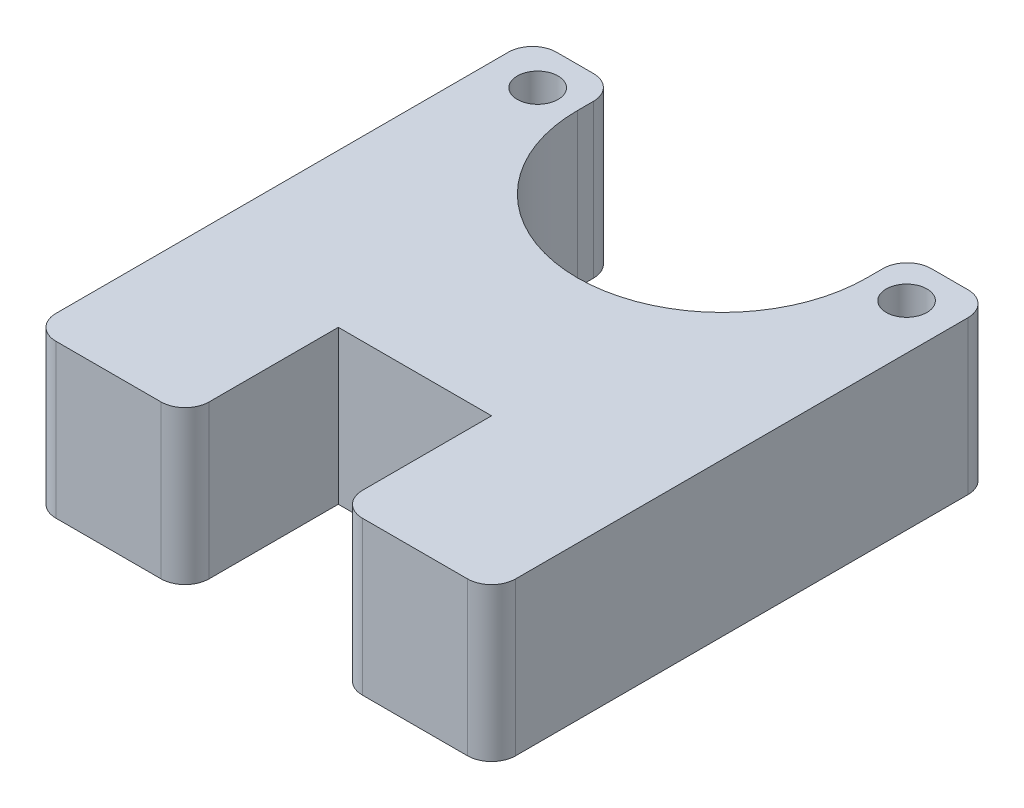
ISO-10303-21;
HEADER;
FILE_DESCRIPTION(('STEP AP214'),'2;1');
FILE_NAME('part.step','',(''),(''),'','','');
FILE_SCHEMA(('AUTOMOTIVE_DESIGN { 1 0 10303 214 1 1 1 1 }'));
ENDSEC;
DATA;
#1=APPLICATION_CONTEXT('core data for automotive mechanical design processes');
#2=APPLICATION_PROTOCOL_DEFINITION('international standard','automotive_design',2000,#1);
#3=PRODUCT_CONTEXT('',#1,'mechanical');
#4=PRODUCT('Part','Part','',(#3));
#5=PRODUCT_RELATED_PRODUCT_CATEGORY('part','',(#4));
#6=PRODUCT_DEFINITION_FORMATION('','',#4);
#7=PRODUCT_DEFINITION_CONTEXT('part definition',#1,'design');
#8=PRODUCT_DEFINITION('design','',#6,#7);
#9=PRODUCT_DEFINITION_SHAPE('','',#8);
#10=(LENGTH_UNIT() NAMED_UNIT(*) SI_UNIT(.MILLI.,.METRE.));
#11=(NAMED_UNIT(*) PLANE_ANGLE_UNIT() SI_UNIT($,.RADIAN.));
#12=(NAMED_UNIT(*) SI_UNIT($,.STERADIAN.) SOLID_ANGLE_UNIT());
#13=UNCERTAINTY_MEASURE_WITH_UNIT(LENGTH_MEASURE(1.E-05),#10,'distance_accuracy_value','');
#14=(GEOMETRIC_REPRESENTATION_CONTEXT(3) GLOBAL_UNCERTAINTY_ASSIGNED_CONTEXT((#13)) GLOBAL_UNIT_ASSIGNED_CONTEXT((#10,
#11,#12)) REPRESENTATION_CONTEXT('',''));
#15=CARTESIAN_POINT('',(0.,0.,0.));
#16=DIRECTION('',(0.,0.,1.));
#17=DIRECTION('',(1.,0.,0.));
#18=AXIS2_PLACEMENT_3D('',#15,#16,#17);
#19=CARTESIAN_POINT('',(19.05,6.35,0.));
#20=DIRECTION('',(-1.,0.,0.));
#21=DIRECTION('',(0.,0.,1.));
#22=AXIS2_PLACEMENT_3D('',#19,#20,#21);
#23=PLANE('',#22);
#24=DIRECTION('',(0.,0.,-1.));
#25=VECTOR('',#24,1.);
#26=CARTESIAN_POINT('',(19.05,6.35,0.));
#27=LINE('',#26,#25);
#28=CARTESIAN_POINT('',(19.05,6.35,5.35));
#29=VERTEX_POINT('',#28);
#30=CARTESIAN_POINT('',(19.05,6.35,-13.393729658));
#31=VERTEX_POINT('',#30);
#32=EDGE_CURVE('E269',#29,#31,#27,.T.);
#33=ORIENTED_EDGE('',*,*,#32,.F.);
#34=DIRECTION('',(0.,-1.,0.));
#35=VECTOR('',#34,1.);
#36=CARTESIAN_POINT('',(19.05,0.,5.35));
#37=LINE('',#36,#35);
#38=CARTESIAN_POINT('',(19.05,0.,5.35));
#39=VERTEX_POINT('',#38);
#40=EDGE_CURVE('E276',#29,#39,#37,.T.);
#41=ORIENTED_EDGE('',*,*,#40,.T.);
#42=DIRECTION('',(0.,0.,-1.));
#43=VECTOR('',#42,1.);
#44=CARTESIAN_POINT('',(19.05,0.,0.));
#45=LINE('',#44,#43);
#46=CARTESIAN_POINT('',(19.05,0.,-13.393729658));
#47=VERTEX_POINT('',#46);
#48=EDGE_CURVE('E232',#39,#47,#45,.T.);
#49=ORIENTED_EDGE('',*,*,#48,.T.);
#50=DIRECTION('',(0.,-1.,0.));
#51=VECTOR('',#50,1.);
#52=CARTESIAN_POINT('',(19.05,6.35,-13.393729658));
#53=LINE('',#52,#51);
#54=EDGE_CURVE('E187',#47,#31,#53,.F.);
#55=ORIENTED_EDGE('',*,*,#54,.T.);
#56=EDGE_LOOP('',(#33,#41,#49,#55));
#57=FACE_BOUND('',#56,.T.);
#58=ADVANCED_FACE('F35',(#57),#23,.F.);
#59=CARTESIAN_POINT('',(0.,6.35,-14.393729658));
#60=DIRECTION('',(0.,0.,1.));
#61=DIRECTION('',(1.,0.,0.));
#62=AXIS2_PLACEMENT_3D('',#59,#60,#61);
#63=PLANE('',#62);
#64=DIRECTION('',(-1.,0.,0.));
#65=VECTOR('',#64,1.);
#66=CARTESIAN_POINT('',(0.,6.35,-14.393729658));
#67=LINE('',#66,#65);
#68=CARTESIAN_POINT('',(18.05,6.35,-14.393729658));
#69=VERTEX_POINT('',#68);
#70=CARTESIAN_POINT('',(16.5250007,6.35,-14.393729658));
#71=VERTEX_POINT('',#70);
#72=EDGE_CURVE('E199',#69,#71,#67,.T.);
#73=ORIENTED_EDGE('',*,*,#72,.F.);
#74=DIRECTION('',(0.,-1.,0.));
#75=VECTOR('',#74,1.);
#76=CARTESIAN_POINT('',(18.05,6.35,-14.393729658));
#77=LINE('',#76,#75);
#78=CARTESIAN_POINT('',(18.05,0.,-14.393729658));
#79=VERTEX_POINT('',#78);
#80=EDGE_CURVE('E330',#69,#79,#77,.T.);
#81=ORIENTED_EDGE('',*,*,#80,.T.);
#82=DIRECTION('',(-1.,0.,0.));
#83=VECTOR('',#82,1.);
#84=CARTESIAN_POINT('',(0.,0.,-14.393729658));
#85=LINE('',#84,#83);
#86=CARTESIAN_POINT('',(16.5250007,0.,-14.393729658));
#87=VERTEX_POINT('',#86);
#88=EDGE_CURVE('E235',#79,#87,#85,.T.);
#89=ORIENTED_EDGE('',*,*,#88,.T.);
#90=DIRECTION('',(0.,-1.,0.));
#91=VECTOR('',#90,1.);
#92=CARTESIAN_POINT('',(16.5250007,6.35,-14.393729658));
#93=LINE('',#92,#91);
#94=EDGE_CURVE('E328',#87,#71,#93,.F.);
#95=ORIENTED_EDGE('',*,*,#94,.T.);
#96=EDGE_LOOP('',(#73,#81,#89,#95));
#97=FACE_BOUND('',#96,.T.);
#98=ADVANCED_FACE('F394',(#97),#63,.F.);
#99=CARTESIAN_POINT('',(15.5250007,6.35,0.));
#100=DIRECTION('',(-1.,0.,0.));
#101=DIRECTION('',(0.,0.,1.));
#102=AXIS2_PLACEMENT_3D('',#99,#100,#101);
#103=PLANE('',#102);
#104=DIRECTION('',(0.,0.,-1.));
#105=VECTOR('',#104,1.);
#106=CARTESIAN_POINT('',(15.5250007,6.35,0.));
#107=LINE('',#106,#105);
#108=CARTESIAN_POINT('',(15.5250007,6.35,-12.7287274));
#109=VERTEX_POINT('',#108);
#110=CARTESIAN_POINT('',(15.5250007,6.35,-13.393729658));
#111=VERTEX_POINT('',#110);
#112=EDGE_CURVE('E179',#109,#111,#107,.T.);
#113=ORIENTED_EDGE('',*,*,#112,.T.);
#114=DIRECTION('',(0.,-1.,0.));
#115=VECTOR('',#114,1.);
#116=CARTESIAN_POINT('',(15.5250007,0.,-13.393729658));
#117=LINE('',#116,#115);
#118=CARTESIAN_POINT('',(15.5250007,0.,-13.393729658));
#119=VERTEX_POINT('',#118);
#120=EDGE_CURVE('E333',#111,#119,#117,.T.);
#121=ORIENTED_EDGE('',*,*,#120,.T.);
#122=DIRECTION('',(0.,0.,-1.));
#123=VECTOR('',#122,1.);
#124=CARTESIAN_POINT('',(15.5250007,0.,0.));
#125=LINE('',#124,#123);
#126=CARTESIAN_POINT('',(15.5250007,0.,-12.7287274));
#127=VERTEX_POINT('',#126);
#128=EDGE_CURVE('E182',#127,#119,#125,.T.);
#129=ORIENTED_EDGE('',*,*,#128,.F.);
#130=DIRECTION('',(0.,-1.,0.));
#131=VECTOR('',#130,1.);
#132=CARTESIAN_POINT('',(15.5250007,6.35,-12.7287274));
#133=LINE('',#132,#131);
#134=EDGE_CURVE('E175',#109,#127,#133,.T.);
#135=ORIENTED_EDGE('',*,*,#134,.F.);
#136=EDGE_LOOP('',(#113,#121,#129,#135));
#137=FACE_BOUND('',#136,.T.);
#138=ADVANCED_FACE('F177',(#137),#103,.T.);
#139=CARTESIAN_POINT('',(9.525,6.35,-12.7287274));
#140=DIRECTION('',(0.,-1.,0.));
#141=DIRECTION('',(0.,0.,-1.));
#142=AXIS2_PLACEMENT_3D('',#139,#140,#141);
#143=CYLINDRICAL_SURFACE('',#142,6.0000007);
#144=CARTESIAN_POINT('',(9.525,0.,-12.7287274));
#145=DIRECTION('',(0.,1.,0.));
#146=DIRECTION('',(0.,0.,1.));
#147=AXIS2_PLACEMENT_3D('',#144,#145,#146);
#148=CIRCLE('',#147,6.0000007);
#149=CARTESIAN_POINT('',(3.52499930000392,0.,-12.7287274));
#150=VERTEX_POINT('',#149);
#151=EDGE_CURVE('E239',#150,#127,#148,.T.);
#152=ORIENTED_EDGE('',*,*,#151,.F.);
#153=DIRECTION('',(0.,-1.,0.));
#154=VECTOR('',#153,1.);
#155=CARTESIAN_POINT('',(3.52499930000392,6.35,-12.7287274));
#156=LINE('',#155,#154);
#157=CARTESIAN_POINT('',(3.52499930000392,6.35,-12.7287274));
#158=VERTEX_POINT('',#157);
#159=EDGE_CURVE('E188',#158,#150,#156,.T.);
#160=ORIENTED_EDGE('',*,*,#159,.F.);
#161=CARTESIAN_POINT('',(9.525,6.35,-12.7287274));
#162=DIRECTION('',(0.,1.,0.));
#163=DIRECTION('',(0.,0.,1.));
#164=AXIS2_PLACEMENT_3D('',#161,#162,#163);
#165=CIRCLE('',#164,6.0000007);
#166=EDGE_CURVE('E195',#158,#109,#165,.T.);
#167=ORIENTED_EDGE('',*,*,#166,.T.);
#168=ORIENTED_EDGE('',*,*,#134,.T.);
#169=EDGE_LOOP('',(#152,#160,#167,#168));
#170=FACE_BOUND('',#169,.T.);
#171=ADVANCED_FACE('F201',(#170),#143,.F.);
#172=CARTESIAN_POINT('',(3.52499930000392,6.35,0.));
#173=DIRECTION('',(-1.,0.,0.));
#174=DIRECTION('',(0.,0.,1.));
#175=AXIS2_PLACEMENT_3D('',#172,#173,#174);
#176=PLANE('',#175);
#177=DIRECTION('',(0.,0.,-1.));
#178=VECTOR('',#177,1.);
#179=CARTESIAN_POINT('',(3.52499930000392,0.,0.));
#180=LINE('',#179,#178);
#181=CARTESIAN_POINT('',(3.52499930000392,0.,-13.393729658));
#182=VERTEX_POINT('',#181);
#183=EDGE_CURVE('E241',#150,#182,#180,.T.);
#184=ORIENTED_EDGE('',*,*,#183,.T.);
#185=DIRECTION('',(0.,-1.,0.));
#186=VECTOR('',#185,1.);
#187=CARTESIAN_POINT('',(3.52499930000392,6.35,-13.393729658));
#188=LINE('',#187,#186);
#189=CARTESIAN_POINT('',(3.52499930000392,6.35,-13.393729658));
#190=VERTEX_POINT('',#189);
#191=EDGE_CURVE('E11',#182,#190,#188,.F.);
#192=ORIENTED_EDGE('',*,*,#191,.T.);
#193=DIRECTION('',(0.,0.,-1.));
#194=VECTOR('',#193,1.);
#195=CARTESIAN_POINT('',(3.52499930000392,6.35,0.));
#196=LINE('',#195,#194);
#197=EDGE_CURVE('E203',#158,#190,#196,.T.);
#198=ORIENTED_EDGE('',*,*,#197,.F.);
#199=ORIENTED_EDGE('',*,*,#159,.T.);
#200=EDGE_LOOP('',(#184,#192,#198,#199));
#201=FACE_BOUND('',#200,.T.);
#202=ADVANCED_FACE('F431',(#201),#176,.F.);
#203=CARTESIAN_POINT('',(0.,6.35,-14.393729658));
#204=DIRECTION('',(0.,0.,-1.));
#205=DIRECTION('',(-1.,0.,0.));
#206=AXIS2_PLACEMENT_3D('',#203,#204,#205);
#207=PLANE('',#206);
#208=DIRECTION('',(1.,0.,0.));
#209=VECTOR('',#208,1.);
#210=CARTESIAN_POINT('',(0.,6.35,-14.393729658));
#211=LINE('',#210,#209);
#212=CARTESIAN_POINT('',(1.,6.35,-14.393729658));
#213=VERTEX_POINT('',#212);
#214=CARTESIAN_POINT('',(2.52499930000392,6.35,-14.393729658));
#215=VERTEX_POINT('',#214);
#216=EDGE_CURVE('E205',#213,#215,#211,.T.);
#217=ORIENTED_EDGE('',*,*,#216,.T.);
#218=DIRECTION('',(0.,-1.,0.));
#219=VECTOR('',#218,1.);
#220=CARTESIAN_POINT('',(2.52499930000392,0.,-14.393729658));
#221=LINE('',#220,#219);
#222=CARTESIAN_POINT('',(2.52499930000392,0.,-14.393729658));
#223=VERTEX_POINT('',#222);
#224=EDGE_CURVE('E43',#215,#223,#221,.T.);
#225=ORIENTED_EDGE('',*,*,#224,.T.);
#226=DIRECTION('',(1.,0.,0.));
#227=VECTOR('',#226,1.);
#228=CARTESIAN_POINT('',(0.,0.,-14.393729658));
#229=LINE('',#228,#227);
#230=CARTESIAN_POINT('',(1.,0.,-14.393729658));
#231=VERTEX_POINT('',#230);
#232=EDGE_CURVE('E244',#231,#223,#229,.T.);
#233=ORIENTED_EDGE('',*,*,#232,.F.);
#234=DIRECTION('',(0.,-1.,0.));
#235=VECTOR('',#234,1.);
#236=CARTESIAN_POINT('',(1.,6.35,-14.393729658));
#237=LINE('',#236,#235);
#238=EDGE_CURVE('E335',#231,#213,#237,.F.);
#239=ORIENTED_EDGE('',*,*,#238,.T.);
#240=EDGE_LOOP('',(#217,#225,#233,#239));
#241=FACE_BOUND('',#240,.T.);
#242=ADVANCED_FACE('F340',(#241),#207,.T.);
#243=CARTESIAN_POINT('',(0.,6.35,0.));
#244=DIRECTION('',(-1.,0.,0.));
#245=DIRECTION('',(0.,0.,1.));
#246=AXIS2_PLACEMENT_3D('',#243,#244,#245);
#247=PLANE('',#246);
#248=DIRECTION('',(0.,0.,-1.));
#249=VECTOR('',#248,1.);
#250=CARTESIAN_POINT('',(0.,0.,0.));
#251=LINE('',#250,#249);
#252=CARTESIAN_POINT('',(0.,0.,5.35));
#253=VERTEX_POINT('',#252);
#254=CARTESIAN_POINT('',(0.,0.,-13.393729658));
#255=VERTEX_POINT('',#254);
#256=EDGE_CURVE('E247',#253,#255,#251,.T.);
#257=ORIENTED_EDGE('',*,*,#256,.F.);
#258=DIRECTION('',(0.,-1.,0.));
#259=VECTOR('',#258,1.);
#260=CARTESIAN_POINT('',(0.,6.35,5.35));
#261=LINE('',#260,#259);
#262=CARTESIAN_POINT('',(0.,6.35,5.35));
#263=VERTEX_POINT('',#262);
#264=EDGE_CURVE('E326',#253,#263,#261,.F.);
#265=ORIENTED_EDGE('',*,*,#264,.T.);
#266=DIRECTION('',(0.,0.,-1.));
#267=VECTOR('',#266,1.);
#268=CARTESIAN_POINT('',(0.,6.35,0.));
#269=LINE('',#268,#267);
#270=CARTESIAN_POINT('',(0.,6.35,-13.393729658));
#271=VERTEX_POINT('',#270);
#272=EDGE_CURVE('E211',#263,#271,#269,.T.);
#273=ORIENTED_EDGE('',*,*,#272,.T.);
#274=DIRECTION('',(0.,-1.,0.));
#275=VECTOR('',#274,1.);
#276=CARTESIAN_POINT('',(0.,6.35,-13.393729658));
#277=LINE('',#276,#275);
#278=EDGE_CURVE('E323',#271,#255,#277,.T.);
#279=ORIENTED_EDGE('',*,*,#278,.T.);
#280=EDGE_LOOP('',(#257,#265,#273,#279));
#281=FACE_BOUND('',#280,.T.);
#282=ADVANCED_FACE('F355',(#281),#247,.T.);
#283=CARTESIAN_POINT('',(0.,6.35,6.35));
#284=DIRECTION('',(0.,0.,-1.));
#285=DIRECTION('',(-1.,0.,0.));
#286=AXIS2_PLACEMENT_3D('',#283,#284,#285);
#287=PLANE('',#286);
#288=DIRECTION('',(1.,0.,0.));
#289=VECTOR('',#288,1.);
#290=CARTESIAN_POINT('',(0.,0.,6.35));
#291=LINE('',#290,#289);
#292=CARTESIAN_POINT('',(0.999999999999992,0.,6.35));
#293=VERTEX_POINT('',#292);
#294=CARTESIAN_POINT('',(5.35,0.,6.35));
#295=VERTEX_POINT('',#294);
#296=EDGE_CURVE('E250',#293,#295,#291,.T.);
#297=ORIENTED_EDGE('',*,*,#296,.T.);
#298=DIRECTION('',(0.,-1.,0.));
#299=VECTOR('',#298,1.);
#300=CARTESIAN_POINT('',(5.35,6.35,6.35));
#301=LINE('',#300,#299);
#302=CARTESIAN_POINT('',(5.35,6.35,6.35));
#303=VERTEX_POINT('',#302);
#304=EDGE_CURVE('E321',#295,#303,#301,.F.);
#305=ORIENTED_EDGE('',*,*,#304,.T.);
#306=DIRECTION('',(1.,0.,0.));
#307=VECTOR('',#306,1.);
#308=CARTESIAN_POINT('',(0.,6.35,6.35));
#309=LINE('',#308,#307);
#310=CARTESIAN_POINT('',(0.999999999999992,6.35,6.35));
#311=VERTEX_POINT('',#310);
#312=EDGE_CURVE('E214',#311,#303,#309,.T.);
#313=ORIENTED_EDGE('',*,*,#312,.F.);
#314=DIRECTION('',(0.,-1.,0.));
#315=VECTOR('',#314,1.);
#316=CARTESIAN_POINT('',(0.999999999999992,0.,6.35));
#317=LINE('',#316,#315);
#318=EDGE_CURVE('E318',#311,#293,#317,.T.);
#319=ORIENTED_EDGE('',*,*,#318,.T.);
#320=EDGE_LOOP('',(#297,#305,#313,#319));
#321=FACE_BOUND('',#320,.T.);
#322=ADVANCED_FACE('F365',(#321),#287,.F.);
#323=CARTESIAN_POINT('',(6.35,6.35,0.));
#324=DIRECTION('',(1.,0.,0.));
#325=DIRECTION('',(0.,0.,-1.));
#326=AXIS2_PLACEMENT_3D('',#323,#324,#325);
#327=PLANE('',#326);
#328=DIRECTION('',(0.,0.,1.));
#329=VECTOR('',#328,1.);
#330=CARTESIAN_POINT('',(6.35,6.35,0.));
#331=LINE('',#330,#329);
#332=CARTESIAN_POINT('',(6.35,6.35,0.));
#333=VERTEX_POINT('',#332);
#334=CARTESIAN_POINT('',(6.35,6.35,5.35));
#335=VERTEX_POINT('',#334);
#336=EDGE_CURVE('E216',#333,#335,#331,.T.);
#337=ORIENTED_EDGE('',*,*,#336,.T.);
#338=DIRECTION('',(0.,-1.,0.));
#339=VECTOR('',#338,1.);
#340=CARTESIAN_POINT('',(6.35,0.,5.35));
#341=LINE('',#340,#339);
#342=CARTESIAN_POINT('',(6.35,0.,5.35));
#343=VERTEX_POINT('',#342);
#344=EDGE_CURVE('E315',#335,#343,#341,.T.);
#345=ORIENTED_EDGE('',*,*,#344,.T.);
#346=DIRECTION('',(0.,0.,1.));
#347=VECTOR('',#346,1.);
#348=CARTESIAN_POINT('',(6.35,0.,0.));
#349=LINE('',#348,#347);
#350=CARTESIAN_POINT('',(6.35,0.,0.));
#351=VERTEX_POINT('',#350);
#352=EDGE_CURVE('E253',#351,#343,#349,.T.);
#353=ORIENTED_EDGE('',*,*,#352,.F.);
#354=DIRECTION('',(0.,-1.,0.));
#355=VECTOR('',#354,1.);
#356=CARTESIAN_POINT('',(6.35,6.35,0.));
#357=LINE('',#356,#355);
#358=EDGE_CURVE('E272',#333,#351,#357,.T.);
#359=ORIENTED_EDGE('',*,*,#358,.F.);
#360=EDGE_LOOP('',(#337,#345,#353,#359));
#361=FACE_BOUND('',#360,.T.);
#362=ADVANCED_FACE('F373',(#361),#327,.T.);
#363=CARTESIAN_POINT('',(0.,6.35,0.));
#364=DIRECTION('',(0.,0.,-1.));
#365=DIRECTION('',(-1.,0.,0.));
#366=AXIS2_PLACEMENT_3D('',#363,#364,#365);
#367=PLANE('',#366);
#368=DIRECTION('',(1.,0.,0.));
#369=VECTOR('',#368,1.);
#370=CARTESIAN_POINT('',(0.,0.,0.));
#371=LINE('',#370,#369);
#372=CARTESIAN_POINT('',(12.7,0.,0.));
#373=VERTEX_POINT('',#372);
#374=EDGE_CURVE('E256',#351,#373,#371,.T.);
#375=ORIENTED_EDGE('',*,*,#374,.T.);
#376=DIRECTION('',(0.,-1.,0.));
#377=VECTOR('',#376,1.);
#378=CARTESIAN_POINT('',(12.7,6.35,0.));
#379=LINE('',#378,#377);
#380=CARTESIAN_POINT('',(12.7,6.35,0.));
#381=VERTEX_POINT('',#380);
#382=EDGE_CURVE('E231',#381,#373,#379,.T.);
#383=ORIENTED_EDGE('',*,*,#382,.F.);
#384=DIRECTION('',(1.,0.,0.));
#385=VECTOR('',#384,1.);
#386=CARTESIAN_POINT('',(0.,6.35,0.));
#387=LINE('',#386,#385);
#388=EDGE_CURVE('E218',#333,#381,#387,.T.);
#389=ORIENTED_EDGE('',*,*,#388,.F.);
#390=ORIENTED_EDGE('',*,*,#358,.T.);
#391=EDGE_LOOP('',(#375,#383,#389,#390));
#392=FACE_BOUND('',#391,.T.);
#393=ADVANCED_FACE('F378',(#392),#367,.F.);
#394=CARTESIAN_POINT('',(12.7,6.35,0.));
#395=DIRECTION('',(1.,0.,0.));
#396=DIRECTION('',(0.,0.,-1.));
#397=AXIS2_PLACEMENT_3D('',#394,#395,#396);
#398=PLANE('',#397);
#399=DIRECTION('',(0.,0.,1.));
#400=VECTOR('',#399,1.);
#401=CARTESIAN_POINT('',(12.7,0.,0.));
#402=LINE('',#401,#400);
#403=CARTESIAN_POINT('',(12.7,0.,5.35));
#404=VERTEX_POINT('',#403);
#405=EDGE_CURVE('E258',#373,#404,#402,.T.);
#406=ORIENTED_EDGE('',*,*,#405,.T.);
#407=DIRECTION('',(0.,-1.,0.));
#408=VECTOR('',#407,1.);
#409=CARTESIAN_POINT('',(12.7,6.35,5.35));
#410=LINE('',#409,#408);
#411=CARTESIAN_POINT('',(12.7,6.35,5.35));
#412=VERTEX_POINT('',#411);
#413=EDGE_CURVE('E50',#404,#412,#410,.F.);
#414=ORIENTED_EDGE('',*,*,#413,.T.);
#415=DIRECTION('',(0.,0.,1.));
#416=VECTOR('',#415,1.);
#417=CARTESIAN_POINT('',(12.7,6.35,0.));
#418=LINE('',#417,#416);
#419=EDGE_CURVE('E220',#381,#412,#418,.T.);
#420=ORIENTED_EDGE('',*,*,#419,.F.);
#421=ORIENTED_EDGE('',*,*,#382,.T.);
#422=EDGE_LOOP('',(#406,#414,#420,#421));
#423=FACE_BOUND('',#422,.T.);
#424=ADVANCED_FACE('F380',(#423),#398,.F.);
#425=CARTESIAN_POINT('',(1.88250068000392,6.35,-12.728734258));
#426=DIRECTION('',(0.,-1.,0.));
#427=DIRECTION('',(0.,0.,-1.));
#428=AXIS2_PLACEMENT_3D('',#425,#426,#427);
#429=CYLINDRICAL_SURFACE('',#428,0.8449945);
#430=CARTESIAN_POINT('',(1.88250068000392,6.35,-12.728734258));
#431=DIRECTION('',(0.,1.,0.));
#432=DIRECTION('',(0.,0.,1.));
#433=AXIS2_PLACEMENT_3D('',#430,#431,#432);
#434=CIRCLE('',#433,0.8449945);
#435=CARTESIAN_POINT('',(1.88250068000392,6.35,-11.883739758));
#436=VERTEX_POINT('',#435);
#437=EDGE_CURVE('E225',#436,#436,#434,.T.);
#438=ORIENTED_EDGE('',*,*,#437,.T.);
#439=EDGE_LOOP('',(#438));
#440=FACE_BOUND('',#439,.T.);
#441=CARTESIAN_POINT('',(1.88250068000392,0.,-12.728734258));
#442=DIRECTION('',(0.,1.,0.));
#443=DIRECTION('',(0.,0.,1.));
#444=AXIS2_PLACEMENT_3D('',#441,#442,#443);
#445=CIRCLE('',#444,0.8449945);
#446=CARTESIAN_POINT('',(1.88250068000392,0.,-11.883739758));
#447=VERTEX_POINT('',#446);
#448=EDGE_CURVE('E263',#447,#447,#445,.T.);
#449=ORIENTED_EDGE('',*,*,#448,.F.);
#450=EDGE_LOOP('',(#449));
#451=FACE_BOUND('',#450,.T.);
#452=ADVANCED_FACE('F382',(#440,#451),#429,.F.);
#453=CARTESIAN_POINT('',(0.,6.35,6.35));
#454=DIRECTION('',(0.,0.,1.));
#455=DIRECTION('',(1.,0.,0.));
#456=AXIS2_PLACEMENT_3D('',#453,#454,#455);
#457=PLANE('',#456);
#458=DIRECTION('',(-1.,0.,0.));
#459=VECTOR('',#458,1.);
#460=CARTESIAN_POINT('',(0.,0.,6.35));
#461=LINE('',#460,#459);
#462=CARTESIAN_POINT('',(18.05,0.,6.35));
#463=VERTEX_POINT('',#462);
#464=CARTESIAN_POINT('',(13.7,0.,6.35));
#465=VERTEX_POINT('',#464);
#466=EDGE_CURVE('E260',#463,#465,#461,.T.);
#467=ORIENTED_EDGE('',*,*,#466,.F.);
#468=DIRECTION('',(0.,-1.,0.));
#469=VECTOR('',#468,1.);
#470=CARTESIAN_POINT('',(18.05,6.35,6.35));
#471=LINE('',#470,#469);
#472=CARTESIAN_POINT('',(18.05,6.35,6.35));
#473=VERTEX_POINT('',#472);
#474=EDGE_CURVE('E298',#463,#473,#471,.F.);
#475=ORIENTED_EDGE('',*,*,#474,.T.);
#476=DIRECTION('',(-1.,0.,0.));
#477=VECTOR('',#476,1.);
#478=CARTESIAN_POINT('',(0.,6.35,6.35));
#479=LINE('',#478,#477);
#480=CARTESIAN_POINT('',(13.7,6.35,6.35));
#481=VERTEX_POINT('',#480);
#482=EDGE_CURVE('E222',#473,#481,#479,.T.);
#483=ORIENTED_EDGE('',*,*,#482,.T.);
#484=DIRECTION('',(0.,-1.,0.));
#485=VECTOR('',#484,1.);
#486=CARTESIAN_POINT('',(13.7,0.,6.35));
#487=LINE('',#486,#485);
#488=EDGE_CURVE('E295',#481,#465,#487,.T.);
#489=ORIENTED_EDGE('',*,*,#488,.T.);
#490=EDGE_LOOP('',(#467,#475,#483,#489));
#491=FACE_BOUND('',#490,.T.);
#492=ADVANCED_FACE('F388',(#491),#457,.T.);
#493=CARTESIAN_POINT('',(17.16749932,6.35,-12.7287274));
#494=DIRECTION('',(0.,-1.,0.));
#495=DIRECTION('',(0.,0.,-1.));
#496=AXIS2_PLACEMENT_3D('',#493,#494,#495);
#497=CYLINDRICAL_SURFACE('',#496,0.844994500000003);
#498=CARTESIAN_POINT('',(17.16749932,6.35,-12.7287274));
#499=DIRECTION('',(0.,1.,0.));
#500=DIRECTION('',(0.,0.,1.));
#501=AXIS2_PLACEMENT_3D('',#498,#499,#500);
#502=CIRCLE('',#501,0.844994500000003);
#503=CARTESIAN_POINT('',(17.16749932,6.35,-11.8837329));
#504=VERTEX_POINT('',#503);
#505=EDGE_CURVE('E228',#504,#504,#502,.T.);
#506=ORIENTED_EDGE('',*,*,#505,.T.);
#507=EDGE_LOOP('',(#506));
#508=FACE_BOUND('',#507,.T.);
#509=CARTESIAN_POINT('',(17.16749932,0.,-12.7287274));
#510=DIRECTION('',(0.,1.,0.));
#511=DIRECTION('',(0.,0.,1.));
#512=AXIS2_PLACEMENT_3D('',#509,#510,#511);
#513=CIRCLE('',#512,0.844994500000003);
#514=CARTESIAN_POINT('',(17.16749932,0.,-11.8837329));
#515=VERTEX_POINT('',#514);
#516=EDGE_CURVE('E266',#515,#515,#513,.T.);
#517=ORIENTED_EDGE('',*,*,#516,.F.);
#518=EDGE_LOOP('',(#517));
#519=FACE_BOUND('',#518,.T.);
#520=ADVANCED_FACE('F447',(#508,#519),#497,.F.);
#521=CARTESIAN_POINT('',(0.,6.35,0.));
#522=DIRECTION('',(0.,1.,0.));
#523=DIRECTION('',(0.,0.,1.));
#524=AXIS2_PLACEMENT_3D('',#521,#522,#523);
#525=PLANE('',#524);
#526=ORIENTED_EDGE('',*,*,#482,.F.);
#527=CARTESIAN_POINT('',(18.05,6.35,5.35));
#528=DIRECTION('',(0.,1.,0.));
#529=DIRECTION('',(0.,0.,1.));
#530=AXIS2_PLACEMENT_3D('',#527,#528,#529);
#531=CIRCLE('',#530,1.);
#532=EDGE_CURVE('E312',#473,#29,#531,.T.);
#533=ORIENTED_EDGE('',*,*,#532,.T.);
#534=ORIENTED_EDGE('',*,*,#32,.T.);
#535=CARTESIAN_POINT('',(18.05,6.35,-13.393729658));
#536=DIRECTION('',(0.,1.,0.));
#537=DIRECTION('',(0.,0.,1.));
#538=AXIS2_PLACEMENT_3D('',#535,#536,#537);
#539=CIRCLE('',#538,1.);
#540=EDGE_CURVE('E305',#31,#69,#539,.T.);
#541=ORIENTED_EDGE('',*,*,#540,.T.);
#542=ORIENTED_EDGE('',*,*,#72,.T.);
#543=CARTESIAN_POINT('',(16.5250007,6.35,-13.393729658));
#544=DIRECTION('',(0.,1.,0.));
#545=DIRECTION('',(0.,0.,1.));
#546=AXIS2_PLACEMENT_3D('',#543,#544,#545);
#547=CIRCLE('',#546,1.);
#548=EDGE_CURVE('E198',#71,#111,#547,.T.);
#549=ORIENTED_EDGE('',*,*,#548,.T.);
#550=ORIENTED_EDGE('',*,*,#112,.F.);
#551=ORIENTED_EDGE('',*,*,#166,.F.);
#552=ORIENTED_EDGE('',*,*,#197,.T.);
#553=CARTESIAN_POINT('',(2.52499930000392,6.35,-13.393729658));
#554=DIRECTION('',(0.,1.,0.));
#555=DIRECTION('',(0.,0.,1.));
#556=AXIS2_PLACEMENT_3D('',#553,#554,#555);
#557=CIRCLE('',#556,1.);
#558=EDGE_CURVE('E302',#190,#215,#557,.T.);
#559=ORIENTED_EDGE('',*,*,#558,.T.);
#560=ORIENTED_EDGE('',*,*,#216,.F.);
#561=CARTESIAN_POINT('',(1.,6.35,-13.393729658));
#562=DIRECTION('',(0.,1.,0.));
#563=DIRECTION('',(0.,0.,1.));
#564=AXIS2_PLACEMENT_3D('',#561,#562,#563);
#565=CIRCLE('',#564,1.);
#566=EDGE_CURVE('E300',#213,#271,#565,.T.);
#567=ORIENTED_EDGE('',*,*,#566,.T.);
#568=ORIENTED_EDGE('',*,*,#272,.F.);
#569=CARTESIAN_POINT('',(0.999999999999992,6.35,5.35));
#570=DIRECTION('',(0.,1.,0.));
#571=DIRECTION('',(0.,0.,1.));
#572=AXIS2_PLACEMENT_3D('',#569,#570,#571);
#573=CIRCLE('',#572,1.);
#574=EDGE_CURVE('E307',#263,#311,#573,.T.);
#575=ORIENTED_EDGE('',*,*,#574,.T.);
#576=ORIENTED_EDGE('',*,*,#312,.T.);
#577=CARTESIAN_POINT('',(5.35,6.35,5.35));
#578=DIRECTION('',(0.,1.,0.));
#579=DIRECTION('',(0.,0.,1.));
#580=AXIS2_PLACEMENT_3D('',#577,#578,#579);
#581=CIRCLE('',#580,1.);
#582=EDGE_CURVE('E58',#303,#335,#581,.T.);
#583=ORIENTED_EDGE('',*,*,#582,.T.);
#584=ORIENTED_EDGE('',*,*,#336,.F.);
#585=ORIENTED_EDGE('',*,*,#388,.T.);
#586=ORIENTED_EDGE('',*,*,#419,.T.);
#587=CARTESIAN_POINT('',(13.7,6.35,5.35));
#588=DIRECTION('',(0.,1.,0.));
#589=DIRECTION('',(0.,0.,1.));
#590=AXIS2_PLACEMENT_3D('',#587,#588,#589);
#591=CIRCLE('',#590,1.);
#592=EDGE_CURVE('E310',#412,#481,#591,.T.);
#593=ORIENTED_EDGE('',*,*,#592,.T.);
#594=EDGE_LOOP('',(#526,#533,#534,#541,#542,#549,#550,#551,#552,#559,#560,#567,#568,#575,#576,
#583,#584,#585,#586,#593));
#595=FACE_BOUND('',#594,.T.);
#596=ORIENTED_EDGE('',*,*,#437,.F.);
#597=EDGE_LOOP('',(#596));
#598=FACE_BOUND('',#597,.T.);
#599=ORIENTED_EDGE('',*,*,#505,.F.);
#600=EDGE_LOOP('',(#599));
#601=FACE_BOUND('',#600,.T.);
#602=ADVANCED_FACE('F192',(#595,#598,#601),#525,.T.);
#603=CARTESIAN_POINT('',(0.,0.,0.));
#604=DIRECTION('',(0.,1.,0.));
#605=DIRECTION('',(0.,0.,1.));
#606=AXIS2_PLACEMENT_3D('',#603,#604,#605);
#607=PLANE('',#606);
#608=ORIENTED_EDGE('',*,*,#48,.F.);
#609=CARTESIAN_POINT('',(18.05,0.,5.35));
#610=DIRECTION('',(0.,1.,0.));
#611=DIRECTION('',(0.,0.,1.));
#612=AXIS2_PLACEMENT_3D('',#609,#610,#611);
#613=CIRCLE('',#612,1.);
#614=EDGE_CURVE('E293',#39,#463,#613,.F.);
#615=ORIENTED_EDGE('',*,*,#614,.T.);
#616=ORIENTED_EDGE('',*,*,#466,.T.);
#617=CARTESIAN_POINT('',(13.7,0.,5.35));
#618=DIRECTION('',(0.,1.,0.));
#619=DIRECTION('',(0.,0.,1.));
#620=AXIS2_PLACEMENT_3D('',#617,#618,#619);
#621=CIRCLE('',#620,1.);
#622=EDGE_CURVE('E291',#465,#404,#621,.F.);
#623=ORIENTED_EDGE('',*,*,#622,.T.);
#624=ORIENTED_EDGE('',*,*,#405,.F.);
#625=ORIENTED_EDGE('',*,*,#374,.F.);
#626=ORIENTED_EDGE('',*,*,#352,.T.);
#627=CARTESIAN_POINT('',(5.35,0.,5.35));
#628=DIRECTION('',(0.,1.,0.));
#629=DIRECTION('',(0.,0.,1.));
#630=AXIS2_PLACEMENT_3D('',#627,#628,#629);
#631=CIRCLE('',#630,1.);
#632=EDGE_CURVE('E289',#343,#295,#631,.F.);
#633=ORIENTED_EDGE('',*,*,#632,.T.);
#634=ORIENTED_EDGE('',*,*,#296,.F.);
#635=CARTESIAN_POINT('',(0.999999999999992,0.,5.35));
#636=DIRECTION('',(0.,1.,0.));
#637=DIRECTION('',(0.,0.,1.));
#638=AXIS2_PLACEMENT_3D('',#635,#636,#637);
#639=CIRCLE('',#638,1.);
#640=EDGE_CURVE('E287',#293,#253,#639,.F.);
#641=ORIENTED_EDGE('',*,*,#640,.T.);
#642=ORIENTED_EDGE('',*,*,#256,.T.);
#643=CARTESIAN_POINT('',(1.,0.,-13.393729658));
#644=DIRECTION('',(0.,1.,0.));
#645=DIRECTION('',(0.,0.,1.));
#646=AXIS2_PLACEMENT_3D('',#643,#644,#645);
#647=CIRCLE('',#646,1.);
#648=EDGE_CURVE('E279',#255,#231,#647,.F.);
#649=ORIENTED_EDGE('',*,*,#648,.T.);
#650=ORIENTED_EDGE('',*,*,#232,.T.);
#651=CARTESIAN_POINT('',(2.52499930000392,0.,-13.393729658));
#652=DIRECTION('',(0.,1.,0.));
#653=DIRECTION('',(0.,0.,1.));
#654=AXIS2_PLACEMENT_3D('',#651,#652,#653);
#655=CIRCLE('',#654,1.);
#656=EDGE_CURVE('E281',#223,#182,#655,.F.);
#657=ORIENTED_EDGE('',*,*,#656,.T.);
#658=ORIENTED_EDGE('',*,*,#183,.F.);
#659=ORIENTED_EDGE('',*,*,#151,.T.);
#660=ORIENTED_EDGE('',*,*,#128,.T.);
#661=CARTESIAN_POINT('',(16.5250007,0.,-13.393729658));
#662=DIRECTION('',(0.,1.,0.));
#663=DIRECTION('',(0.,0.,1.));
#664=AXIS2_PLACEMENT_3D('',#661,#662,#663);
#665=CIRCLE('',#664,1.);
#666=EDGE_CURVE('E283',#119,#87,#665,.F.);
#667=ORIENTED_EDGE('',*,*,#666,.T.);
#668=ORIENTED_EDGE('',*,*,#88,.F.);
#669=CARTESIAN_POINT('',(18.05,0.,-13.393729658));
#670=DIRECTION('',(0.,1.,0.));
#671=DIRECTION('',(0.,0.,1.));
#672=AXIS2_PLACEMENT_3D('',#669,#670,#671);
#673=CIRCLE('',#672,1.);
#674=EDGE_CURVE('E285',#79,#47,#673,.F.);
#675=ORIENTED_EDGE('',*,*,#674,.T.);
#676=EDGE_LOOP('',(#608,#615,#616,#623,#624,#625,#626,#633,#634,#641,#642,#649,#650,#657,#658,
#659,#660,#667,#668,#675));
#677=FACE_BOUND('',#676,.T.);
#678=ORIENTED_EDGE('',*,*,#448,.T.);
#679=EDGE_LOOP('',(#678));
#680=FACE_BOUND('',#679,.T.);
#681=ORIENTED_EDGE('',*,*,#516,.T.);
#682=EDGE_LOOP('',(#681));
#683=FACE_BOUND('',#682,.T.);
#684=ADVANCED_FACE('F347',(#677,#680,#683),#607,.F.);
#685=CARTESIAN_POINT('',(18.05,6.35,5.35));
#686=DIRECTION('',(0.,1.,0.));
#687=DIRECTION('',(0.,0.,1.));
#688=AXIS2_PLACEMENT_3D('',#685,#686,#687);
#689=CYLINDRICAL_SURFACE('',#688,1.);
#690=ORIENTED_EDGE('',*,*,#532,.F.);
#691=ORIENTED_EDGE('',*,*,#474,.F.);
#692=ORIENTED_EDGE('',*,*,#614,.F.);
#693=ORIENTED_EDGE('',*,*,#40,.F.);
#694=EDGE_LOOP('',(#690,#691,#692,#693));
#695=FACE_BOUND('',#694,.T.);
#696=ADVANCED_FACE('F405',(#695),#689,.T.);
#697=CARTESIAN_POINT('',(13.7,6.35,5.35));
#698=DIRECTION('',(0.,1.,0.));
#699=DIRECTION('',(0.,0.,1.));
#700=AXIS2_PLACEMENT_3D('',#697,#698,#699);
#701=CYLINDRICAL_SURFACE('',#700,1.);
#702=ORIENTED_EDGE('',*,*,#592,.F.);
#703=ORIENTED_EDGE('',*,*,#413,.F.);
#704=ORIENTED_EDGE('',*,*,#622,.F.);
#705=ORIENTED_EDGE('',*,*,#488,.F.);
#706=EDGE_LOOP('',(#702,#703,#704,#705));
#707=FACE_BOUND('',#706,.T.);
#708=ADVANCED_FACE('F408',(#707),#701,.T.);
#709=CARTESIAN_POINT('',(5.35,6.35,5.35));
#710=DIRECTION('',(0.,1.,0.));
#711=DIRECTION('',(0.,0.,1.));
#712=AXIS2_PLACEMENT_3D('',#709,#710,#711);
#713=CYLINDRICAL_SURFACE('',#712,1.);
#714=ORIENTED_EDGE('',*,*,#582,.F.);
#715=ORIENTED_EDGE('',*,*,#304,.F.);
#716=ORIENTED_EDGE('',*,*,#632,.F.);
#717=ORIENTED_EDGE('',*,*,#344,.F.);
#718=EDGE_LOOP('',(#714,#715,#716,#717));
#719=FACE_BOUND('',#718,.T.);
#720=ADVANCED_FACE('F371',(#719),#713,.T.);
#721=CARTESIAN_POINT('',(0.999999999999992,6.35,5.35));
#722=DIRECTION('',(0.,1.,0.));
#723=DIRECTION('',(0.,0.,1.));
#724=AXIS2_PLACEMENT_3D('',#721,#722,#723);
#725=CYLINDRICAL_SURFACE('',#724,1.);
#726=ORIENTED_EDGE('',*,*,#574,.F.);
#727=ORIENTED_EDGE('',*,*,#264,.F.);
#728=ORIENTED_EDGE('',*,*,#640,.F.);
#729=ORIENTED_EDGE('',*,*,#318,.F.);
#730=EDGE_LOOP('',(#726,#727,#728,#729));
#731=FACE_BOUND('',#730,.T.);
#732=ADVANCED_FACE('F362',(#731),#725,.T.);
#733=CARTESIAN_POINT('',(18.05,6.35,-13.393729658));
#734=DIRECTION('',(0.,-1.,0.));
#735=DIRECTION('',(0.,0.,-1.));
#736=AXIS2_PLACEMENT_3D('',#733,#734,#735);
#737=CYLINDRICAL_SURFACE('',#736,1.);
#738=ORIENTED_EDGE('',*,*,#540,.F.);
#739=ORIENTED_EDGE('',*,*,#54,.F.);
#740=ORIENTED_EDGE('',*,*,#674,.F.);
#741=ORIENTED_EDGE('',*,*,#80,.F.);
#742=EDGE_LOOP('',(#738,#739,#740,#741));
#743=FACE_BOUND('',#742,.T.);
#744=ADVANCED_FACE('F417',(#743),#737,.T.);
#745=CARTESIAN_POINT('',(16.5250007,6.35,-13.393729658));
#746=DIRECTION('',(0.,1.,0.));
#747=DIRECTION('',(0.,0.,1.));
#748=AXIS2_PLACEMENT_3D('',#745,#746,#747);
#749=CYLINDRICAL_SURFACE('',#748,1.);
#750=ORIENTED_EDGE('',*,*,#548,.F.);
#751=ORIENTED_EDGE('',*,*,#94,.F.);
#752=ORIENTED_EDGE('',*,*,#666,.F.);
#753=ORIENTED_EDGE('',*,*,#120,.F.);
#754=EDGE_LOOP('',(#750,#751,#752,#753));
#755=FACE_BOUND('',#754,.T.);
#756=ADVANCED_FACE('F420',(#755),#749,.T.);
#757=CARTESIAN_POINT('',(2.52499930000392,6.35,-13.393729658));
#758=DIRECTION('',(0.,1.,0.));
#759=DIRECTION('',(0.,0.,1.));
#760=AXIS2_PLACEMENT_3D('',#757,#758,#759);
#761=CYLINDRICAL_SURFACE('',#760,1.);
#762=ORIENTED_EDGE('',*,*,#558,.F.);
#763=ORIENTED_EDGE('',*,*,#191,.F.);
#764=ORIENTED_EDGE('',*,*,#656,.F.);
#765=ORIENTED_EDGE('',*,*,#224,.F.);
#766=EDGE_LOOP('',(#762,#763,#764,#765));
#767=FACE_BOUND('',#766,.T.);
#768=ADVANCED_FACE('F423',(#767),#761,.T.);
#769=CARTESIAN_POINT('',(1.,6.35,-13.393729658));
#770=DIRECTION('',(0.,-1.,0.));
#771=DIRECTION('',(0.,0.,-1.));
#772=AXIS2_PLACEMENT_3D('',#769,#770,#771);
#773=CYLINDRICAL_SURFACE('',#772,1.);
#774=ORIENTED_EDGE('',*,*,#566,.F.);
#775=ORIENTED_EDGE('',*,*,#238,.F.);
#776=ORIENTED_EDGE('',*,*,#648,.F.);
#777=ORIENTED_EDGE('',*,*,#278,.F.);
#778=EDGE_LOOP('',(#774,#775,#776,#777));
#779=FACE_BOUND('',#778,.T.);
#780=ADVANCED_FACE('F37',(#779),#773,.T.);
#781=CLOSED_SHELL('',(#58,#98,#138,#171,#202,#242,#282,#322,#362,#393,#424,#452,#492,#520,#602,
#684,#696,#708,#720,#732,#744,#756,#768,#780));
#782=MANIFOLD_SOLID_BREP('B2',#781);
#783=ADVANCED_BREP_SHAPE_REPRESENTATION('',(#18,#782),#14);
#784=SHAPE_DEFINITION_REPRESENTATION(#9,#783);
ENDSEC;
END-ISO-10303-21;
